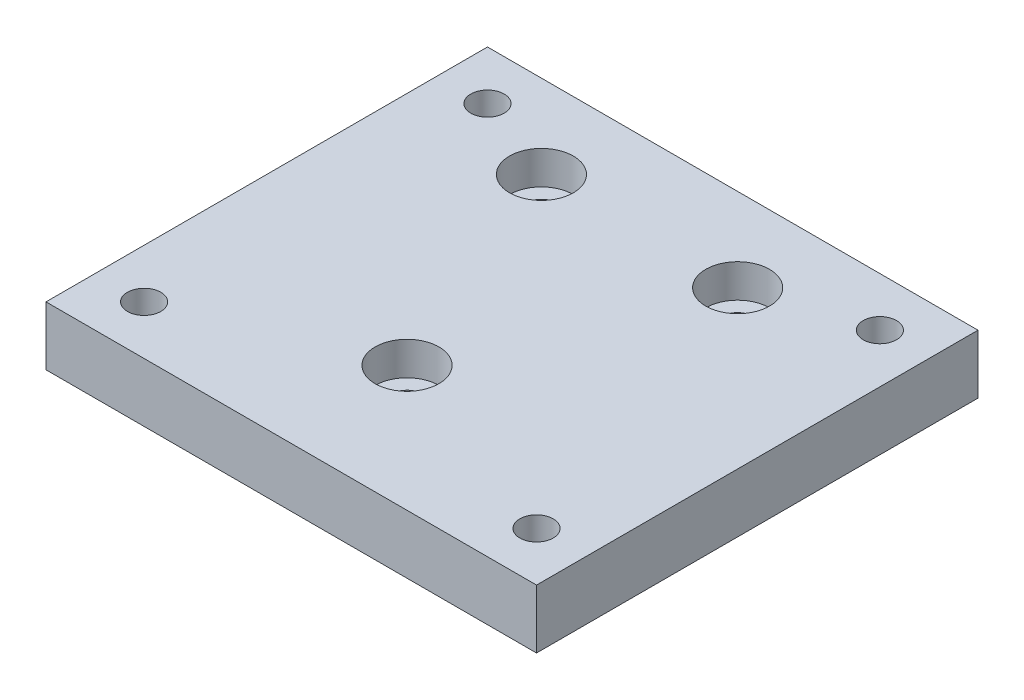
ISO-10303-21;
HEADER;
FILE_DESCRIPTION(('STEP AP214'),'2;1');
FILE_NAME('part.step','',(''),(''),'','','');
FILE_SCHEMA(('AUTOMOTIVE_DESIGN { 1 0 10303 214 1 1 1 1 }'));
ENDSEC;
DATA;
#1=APPLICATION_CONTEXT('core data for automotive mechanical design processes');
#2=APPLICATION_PROTOCOL_DEFINITION('international standard','automotive_design',2000,#1);
#3=PRODUCT_CONTEXT('',#1,'mechanical');
#4=PRODUCT('Part','Part','',(#3));
#5=PRODUCT_RELATED_PRODUCT_CATEGORY('part','',(#4));
#6=PRODUCT_DEFINITION_FORMATION('','',#4);
#7=PRODUCT_DEFINITION_CONTEXT('part definition',#1,'design');
#8=PRODUCT_DEFINITION('design','',#6,#7);
#9=PRODUCT_DEFINITION_SHAPE('','',#8);
#10=(LENGTH_UNIT() NAMED_UNIT(*) SI_UNIT(.MILLI.,.METRE.));
#11=(NAMED_UNIT(*) PLANE_ANGLE_UNIT() SI_UNIT($,.RADIAN.));
#12=(NAMED_UNIT(*) SI_UNIT($,.STERADIAN.) SOLID_ANGLE_UNIT());
#13=UNCERTAINTY_MEASURE_WITH_UNIT(LENGTH_MEASURE(1.E-05),#10,'distance_accuracy_value','');
#14=(GEOMETRIC_REPRESENTATION_CONTEXT(3) GLOBAL_UNCERTAINTY_ASSIGNED_CONTEXT((#13)) GLOBAL_UNIT_ASSIGNED_CONTEXT((#10,
#11,#12)) REPRESENTATION_CONTEXT('',''));
#15=CARTESIAN_POINT('',(0.,0.,0.));
#16=DIRECTION('',(0.,0.,1.));
#17=DIRECTION('',(1.,0.,0.));
#18=AXIS2_PLACEMENT_3D('',#15,#16,#17);
#19=CARTESIAN_POINT('',(25.,6.,-22.5));
#20=DIRECTION('',(-1.,0.,0.));
#21=DIRECTION('',(0.,0.,1.));
#22=AXIS2_PLACEMENT_3D('',#19,#20,#21);
#23=PLANE('',#22);
#24=DIRECTION('',(0.,0.,-1.));
#25=VECTOR('',#24,1.);
#26=CARTESIAN_POINT('',(25.,0.,-22.5));
#27=LINE('',#26,#25);
#28=CARTESIAN_POINT('',(25.,0.,22.5));
#29=VERTEX_POINT('',#28);
#30=CARTESIAN_POINT('',(25.,0.,-22.5));
#31=VERTEX_POINT('',#30);
#32=EDGE_CURVE('E99',#29,#31,#27,.T.);
#33=ORIENTED_EDGE('',*,*,#32,.T.);
#34=DIRECTION('',(0.,-1.,0.));
#35=VECTOR('',#34,1.);
#36=CARTESIAN_POINT('',(25.,6.,-22.5));
#37=LINE('',#36,#35);
#38=CARTESIAN_POINT('',(25.,6.,-22.5));
#39=VERTEX_POINT('',#38);
#40=EDGE_CURVE('E11',#39,#31,#37,.T.);
#41=ORIENTED_EDGE('',*,*,#40,.F.);
#42=DIRECTION('',(0.,0.,-1.));
#43=VECTOR('',#42,1.);
#44=CARTESIAN_POINT('',(25.,6.,-22.5));
#45=LINE('',#44,#43);
#46=CARTESIAN_POINT('',(25.,6.,22.5));
#47=VERTEX_POINT('',#46);
#48=EDGE_CURVE('E87',#47,#39,#45,.T.);
#49=ORIENTED_EDGE('',*,*,#48,.F.);
#50=DIRECTION('',(0.,-1.,0.));
#51=VECTOR('',#50,1.);
#52=CARTESIAN_POINT('',(25.,6.,22.5));
#53=LINE('',#52,#51);
#54=EDGE_CURVE('E95',#47,#29,#53,.T.);
#55=ORIENTED_EDGE('',*,*,#54,.T.);
#56=EDGE_LOOP('',(#33,#41,#49,#55));
#57=FACE_BOUND('',#56,.T.);
#58=ADVANCED_FACE('F36',(#57),#23,.F.);
#59=CARTESIAN_POINT('',(-25.,6.,-22.5));
#60=DIRECTION('',(0.,0.,1.));
#61=DIRECTION('',(1.,0.,0.));
#62=AXIS2_PLACEMENT_3D('',#59,#60,#61);
#63=PLANE('',#62);
#64=DIRECTION('',(-1.,0.,0.));
#65=VECTOR('',#64,1.);
#66=CARTESIAN_POINT('',(-25.,0.,-22.5));
#67=LINE('',#66,#65);
#68=CARTESIAN_POINT('',(-25.,0.,-22.5));
#69=VERTEX_POINT('',#68);
#70=EDGE_CURVE('E91',#31,#69,#67,.T.);
#71=ORIENTED_EDGE('',*,*,#70,.T.);
#72=DIRECTION('',(0.,-1.,0.));
#73=VECTOR('',#72,1.);
#74=CARTESIAN_POINT('',(-25.,6.,-22.5));
#75=LINE('',#74,#73);
#76=CARTESIAN_POINT('',(-25.,6.,-22.5));
#77=VERTEX_POINT('',#76);
#78=EDGE_CURVE('E44',#77,#69,#75,.T.);
#79=ORIENTED_EDGE('',*,*,#78,.F.);
#80=DIRECTION('',(-1.,0.,0.));
#81=VECTOR('',#80,1.);
#82=CARTESIAN_POINT('',(-25.,6.,-22.5));
#83=LINE('',#82,#81);
#84=EDGE_CURVE('E82',#39,#77,#83,.T.);
#85=ORIENTED_EDGE('',*,*,#84,.F.);
#86=ORIENTED_EDGE('',*,*,#40,.T.);
#87=EDGE_LOOP('',(#71,#79,#85,#86));
#88=FACE_BOUND('',#87,.T.);
#89=ADVANCED_FACE('F90',(#88),#63,.F.);
#90=CARTESIAN_POINT('',(-25.,6.,-22.5));
#91=DIRECTION('',(1.,0.,0.));
#92=DIRECTION('',(0.,0.,-1.));
#93=AXIS2_PLACEMENT_3D('',#90,#91,#92);
#94=PLANE('',#93);
#95=DIRECTION('',(0.,0.,1.));
#96=VECTOR('',#95,1.);
#97=CARTESIAN_POINT('',(-25.,0.,-22.5));
#98=LINE('',#97,#96);
#99=CARTESIAN_POINT('',(-25.,0.,22.5));
#100=VERTEX_POINT('',#99);
#101=EDGE_CURVE('E69',#69,#100,#98,.T.);
#102=ORIENTED_EDGE('',*,*,#101,.T.);
#103=DIRECTION('',(0.,-1.,0.));
#104=VECTOR('',#103,1.);
#105=CARTESIAN_POINT('',(-25.,6.,22.5));
#106=LINE('',#105,#104);
#107=CARTESIAN_POINT('',(-25.,6.,22.5));
#108=VERTEX_POINT('',#107);
#109=EDGE_CURVE('E92',#108,#100,#106,.T.);
#110=ORIENTED_EDGE('',*,*,#109,.F.);
#111=DIRECTION('',(0.,0.,1.));
#112=VECTOR('',#111,1.);
#113=CARTESIAN_POINT('',(-25.,6.,-22.5));
#114=LINE('',#113,#112);
#115=EDGE_CURVE('E85',#77,#108,#114,.T.);
#116=ORIENTED_EDGE('',*,*,#115,.F.);
#117=ORIENTED_EDGE('',*,*,#78,.T.);
#118=EDGE_LOOP('',(#102,#110,#116,#117));
#119=FACE_BOUND('',#118,.T.);
#120=ADVANCED_FACE('F93',(#119),#94,.F.);
#121=CARTESIAN_POINT('',(-25.,6.,22.5));
#122=DIRECTION('',(0.,0.,-1.));
#123=DIRECTION('',(-1.,0.,0.));
#124=AXIS2_PLACEMENT_3D('',#121,#122,#123);
#125=PLANE('',#124);
#126=DIRECTION('',(1.,0.,0.));
#127=VECTOR('',#126,1.);
#128=CARTESIAN_POINT('',(-25.,0.,22.5));
#129=LINE('',#128,#127);
#130=EDGE_CURVE('E75',#100,#29,#129,.T.);
#131=ORIENTED_EDGE('',*,*,#130,.T.);
#132=ORIENTED_EDGE('',*,*,#54,.F.);
#133=DIRECTION('',(1.,0.,0.));
#134=VECTOR('',#133,1.);
#135=CARTESIAN_POINT('',(-25.,6.,22.5));
#136=LINE('',#135,#134);
#137=EDGE_CURVE('E52',#108,#47,#136,.T.);
#138=ORIENTED_EDGE('',*,*,#137,.F.);
#139=ORIENTED_EDGE('',*,*,#109,.T.);
#140=EDGE_LOOP('',(#131,#132,#138,#139));
#141=FACE_BOUND('',#140,.T.);
#142=ADVANCED_FACE('F107',(#141),#125,.F.);
#143=CARTESIAN_POINT('',(0.,6.,0.));
#144=DIRECTION('',(0.,1.,0.));
#145=DIRECTION('',(0.,0.,1.));
#146=AXIS2_PLACEMENT_3D('',#143,#144,#145);
#147=PLANE('',#146);
#148=CARTESIAN_POINT('',(-11.,6.,-14.));
#149=DIRECTION('',(0.,1.,0.));
#150=DIRECTION('',(0.,0.,1.));
#151=AXIS2_PLACEMENT_3D('',#148,#149,#150);
#152=CIRCLE('',#151,3.25);
#153=CARTESIAN_POINT('',(-11.,6.,-10.75));
#154=VERTEX_POINT('',#153);
#155=EDGE_CURVE('E193',#154,#154,#152,.T.);
#156=ORIENTED_EDGE('',*,*,#155,.F.);
#157=EDGE_LOOP('',(#156));
#158=FACE_BOUND('',#157,.T.);
#159=CARTESIAN_POINT('',(9.,6.,-14.));
#160=DIRECTION('',(0.,1.,0.));
#161=DIRECTION('',(0.,0.,1.));
#162=AXIS2_PLACEMENT_3D('',#159,#160,#161);
#163=CIRCLE('',#162,3.25);
#164=CARTESIAN_POINT('',(9.,6.,-10.75));
#165=VERTEX_POINT('',#164);
#166=EDGE_CURVE('E181',#165,#165,#163,.T.);
#167=ORIENTED_EDGE('',*,*,#166,.F.);
#168=EDGE_LOOP('',(#167));
#169=FACE_BOUND('',#168,.T.);
#170=CARTESIAN_POINT('',(-0.999999999999999,6.,9.7));
#171=DIRECTION('',(0.,1.,0.));
#172=DIRECTION('',(0.,0.,1.));
#173=AXIS2_PLACEMENT_3D('',#170,#171,#172);
#174=CIRCLE('',#173,3.25);
#175=CARTESIAN_POINT('',(-0.999999999999999,6.,12.95));
#176=VERTEX_POINT('',#175);
#177=EDGE_CURVE('E169',#176,#176,#174,.T.);
#178=ORIENTED_EDGE('',*,*,#177,.F.);
#179=EDGE_LOOP('',(#178));
#180=FACE_BOUND('',#179,.T.);
#181=CARTESIAN_POINT('',(-20.,6.00000000000001,17.5));
#182=DIRECTION('',(0.,-1.,0.));
#183=DIRECTION('',(0.,0.,-1.));
#184=AXIS2_PLACEMENT_3D('',#181,#182,#183);
#185=CIRCLE('',#184,1.70000000000001);
#186=CARTESIAN_POINT('',(-20.,6.00000000000001,15.8));
#187=VERTEX_POINT('',#186);
#188=EDGE_CURVE('E148',#187,#187,#185,.T.);
#189=ORIENTED_EDGE('',*,*,#188,.T.);
#190=EDGE_LOOP('',(#189));
#191=FACE_BOUND('',#190,.T.);
#192=CARTESIAN_POINT('',(20.,6.00000000000001,17.5));
#193=DIRECTION('',(0.,-1.,0.));
#194=DIRECTION('',(0.,0.,-1.));
#195=AXIS2_PLACEMENT_3D('',#192,#193,#194);
#196=CIRCLE('',#195,1.70000000000001);
#197=CARTESIAN_POINT('',(20.,6.00000000000001,15.8));
#198=VERTEX_POINT('',#197);
#199=EDGE_CURVE('E136',#198,#198,#196,.T.);
#200=ORIENTED_EDGE('',*,*,#199,.T.);
#201=EDGE_LOOP('',(#200));
#202=FACE_BOUND('',#201,.T.);
#203=CARTESIAN_POINT('',(20.,6.00000000000001,-17.5));
#204=DIRECTION('',(0.,-1.,0.));
#205=DIRECTION('',(0.,0.,-1.));
#206=AXIS2_PLACEMENT_3D('',#203,#204,#205);
#207=CIRCLE('',#206,1.70000000000001);
#208=CARTESIAN_POINT('',(20.,6.00000000000001,-19.2));
#209=VERTEX_POINT('',#208);
#210=EDGE_CURVE('E124',#209,#209,#207,.T.);
#211=ORIENTED_EDGE('',*,*,#210,.T.);
#212=EDGE_LOOP('',(#211));
#213=FACE_BOUND('',#212,.T.);
#214=CARTESIAN_POINT('',(-20.,6.00000000000001,-17.5));
#215=DIRECTION('',(0.,-1.,0.));
#216=DIRECTION('',(0.,0.,-1.));
#217=AXIS2_PLACEMENT_3D('',#214,#215,#216);
#218=CIRCLE('',#217,1.70000000000001);
#219=CARTESIAN_POINT('',(-20.,6.00000000000001,-19.2));
#220=VERTEX_POINT('',#219);
#221=EDGE_CURVE('E102',#220,#220,#218,.T.);
#222=ORIENTED_EDGE('',*,*,#221,.T.);
#223=EDGE_LOOP('',(#222));
#224=FACE_BOUND('',#223,.T.);
#225=ORIENTED_EDGE('',*,*,#48,.T.);
#226=ORIENTED_EDGE('',*,*,#84,.T.);
#227=ORIENTED_EDGE('',*,*,#115,.T.);
#228=ORIENTED_EDGE('',*,*,#137,.T.);
#229=EDGE_LOOP('',(#225,#226,#227,#228));
#230=FACE_BOUND('',#229,.T.);
#231=ADVANCED_FACE('F83',(#158,#169,#180,#191,#202,#213,#224,#230),#147,.T.);
#232=CARTESIAN_POINT('',(0.,0.,0.));
#233=DIRECTION('',(0.,1.,0.));
#234=DIRECTION('',(0.,0.,1.));
#235=AXIS2_PLACEMENT_3D('',#232,#233,#234);
#236=PLANE('',#235);
#237=CARTESIAN_POINT('',(-11.,0.,-14.));
#238=DIRECTION('',(0.,1.,0.));
#239=DIRECTION('',(0.,0.,1.));
#240=AXIS2_PLACEMENT_3D('',#237,#238,#239);
#241=CIRCLE('',#240,1.7);
#242=CARTESIAN_POINT('',(-11.,0.,-12.3));
#243=VERTEX_POINT('',#242);
#244=EDGE_CURVE('E184',#243,#243,#241,.T.);
#245=ORIENTED_EDGE('',*,*,#244,.T.);
#246=EDGE_LOOP('',(#245));
#247=FACE_BOUND('',#246,.T.);
#248=CARTESIAN_POINT('',(9.,0.,-14.));
#249=DIRECTION('',(0.,1.,0.));
#250=DIRECTION('',(0.,0.,1.));
#251=AXIS2_PLACEMENT_3D('',#248,#249,#250);
#252=CIRCLE('',#251,1.7);
#253=CARTESIAN_POINT('',(9.,0.,-12.3));
#254=VERTEX_POINT('',#253);
#255=EDGE_CURVE('E172',#254,#254,#252,.T.);
#256=ORIENTED_EDGE('',*,*,#255,.T.);
#257=EDGE_LOOP('',(#256));
#258=FACE_BOUND('',#257,.T.);
#259=CARTESIAN_POINT('',(-0.999999999999999,0.,9.7));
#260=DIRECTION('',(0.,1.,0.));
#261=DIRECTION('',(0.,0.,1.));
#262=AXIS2_PLACEMENT_3D('',#259,#260,#261);
#263=CIRCLE('',#262,1.7);
#264=CARTESIAN_POINT('',(-0.999999999999999,0.,11.4));
#265=VERTEX_POINT('',#264);
#266=EDGE_CURVE('E160',#265,#265,#263,.T.);
#267=ORIENTED_EDGE('',*,*,#266,.T.);
#268=EDGE_LOOP('',(#267));
#269=FACE_BOUND('',#268,.T.);
#270=CARTESIAN_POINT('',(-20.,0.,17.5));
#271=DIRECTION('',(0.,-1.,0.));
#272=DIRECTION('',(0.,0.,-1.));
#273=AXIS2_PLACEMENT_3D('',#270,#271,#272);
#274=CIRCLE('',#273,3.25);
#275=CARTESIAN_POINT('',(-20.,0.,14.25));
#276=VERTEX_POINT('',#275);
#277=EDGE_CURVE('E157',#276,#276,#274,.T.);
#278=ORIENTED_EDGE('',*,*,#277,.F.);
#279=EDGE_LOOP('',(#278));
#280=FACE_BOUND('',#279,.T.);
#281=CARTESIAN_POINT('',(20.,0.,17.5));
#282=DIRECTION('',(0.,-1.,0.));
#283=DIRECTION('',(0.,0.,-1.));
#284=AXIS2_PLACEMENT_3D('',#281,#282,#283);
#285=CIRCLE('',#284,3.25);
#286=CARTESIAN_POINT('',(20.,0.,14.25));
#287=VERTEX_POINT('',#286);
#288=EDGE_CURVE('E145',#287,#287,#285,.T.);
#289=ORIENTED_EDGE('',*,*,#288,.F.);
#290=EDGE_LOOP('',(#289));
#291=FACE_BOUND('',#290,.T.);
#292=CARTESIAN_POINT('',(20.,0.,-17.5));
#293=DIRECTION('',(0.,-1.,0.));
#294=DIRECTION('',(0.,0.,-1.));
#295=AXIS2_PLACEMENT_3D('',#292,#293,#294);
#296=CIRCLE('',#295,3.25);
#297=CARTESIAN_POINT('',(20.,0.,-20.75));
#298=VERTEX_POINT('',#297);
#299=EDGE_CURVE('E133',#298,#298,#296,.T.);
#300=ORIENTED_EDGE('',*,*,#299,.F.);
#301=EDGE_LOOP('',(#300));
#302=FACE_BOUND('',#301,.T.);
#303=CARTESIAN_POINT('',(-20.,0.,-17.5));
#304=DIRECTION('',(0.,-1.,0.));
#305=DIRECTION('',(0.,0.,-1.));
#306=AXIS2_PLACEMENT_3D('',#303,#304,#305);
#307=CIRCLE('',#306,3.25);
#308=CARTESIAN_POINT('',(-20.,0.,-20.75));
#309=VERTEX_POINT('',#308);
#310=EDGE_CURVE('E121',#309,#309,#307,.T.);
#311=ORIENTED_EDGE('',*,*,#310,.F.);
#312=EDGE_LOOP('',(#311));
#313=FACE_BOUND('',#312,.T.);
#314=ORIENTED_EDGE('',*,*,#32,.F.);
#315=ORIENTED_EDGE('',*,*,#130,.F.);
#316=ORIENTED_EDGE('',*,*,#101,.F.);
#317=ORIENTED_EDGE('',*,*,#70,.F.);
#318=EDGE_LOOP('',(#314,#315,#316,#317));
#319=FACE_BOUND('',#318,.T.);
#320=ADVANCED_FACE('F110',(#247,#258,#269,#280,#291,#302,#313,#319),#236,.F.);
#321=CARTESIAN_POINT('',(-20.,0.,-17.5));
#322=DIRECTION('',(0.,-1.,0.));
#323=DIRECTION('',(0.,0.,-1.));
#324=AXIS2_PLACEMENT_3D('',#321,#322,#323);
#325=CYLINDRICAL_SURFACE('',#324,1.70000000000001);
#326=ORIENTED_EDGE('',*,*,#221,.F.);
#327=EDGE_LOOP('',(#326));
#328=FACE_BOUND('',#327,.T.);
#329=CARTESIAN_POINT('',(-20.,3.4,-17.5));
#330=DIRECTION('',(0.,-1.,0.));
#331=DIRECTION('',(0.,0.,-1.));
#332=AXIS2_PLACEMENT_3D('',#329,#330,#331);
#333=CIRCLE('',#332,1.7);
#334=CARTESIAN_POINT('',(-20.,3.4,-19.2));
#335=VERTEX_POINT('',#334);
#336=EDGE_CURVE('E115',#335,#335,#333,.T.);
#337=ORIENTED_EDGE('',*,*,#336,.T.);
#338=EDGE_LOOP('',(#337));
#339=FACE_BOUND('',#338,.T.);
#340=ADVANCED_FACE('F214',(#328,#339),#325,.F.);
#341=CARTESIAN_POINT('',(-18.3,3.4,-17.5));
#342=DIRECTION('',(0.,1.,0.));
#343=DIRECTION('',(0.,0.,1.));
#344=AXIS2_PLACEMENT_3D('',#341,#342,#343);
#345=PLANE('',#344);
#346=ORIENTED_EDGE('',*,*,#336,.F.);
#347=EDGE_LOOP('',(#346));
#348=FACE_BOUND('',#347,.T.);
#349=CARTESIAN_POINT('',(-20.,3.4,-17.5));
#350=DIRECTION('',(0.,-1.,0.));
#351=DIRECTION('',(0.,0.,-1.));
#352=AXIS2_PLACEMENT_3D('',#349,#350,#351);
#353=CIRCLE('',#352,3.25);
#354=CARTESIAN_POINT('',(-20.,3.4,-20.75));
#355=VERTEX_POINT('',#354);
#356=EDGE_CURVE('E118',#355,#355,#353,.T.);
#357=ORIENTED_EDGE('',*,*,#356,.T.);
#358=EDGE_LOOP('',(#357));
#359=FACE_BOUND('',#358,.T.);
#360=ADVANCED_FACE('F217',(#348,#359),#345,.F.);
#361=CARTESIAN_POINT('',(-20.,0.,-17.5));
#362=DIRECTION('',(0.,-1.,0.));
#363=DIRECTION('',(0.,0.,-1.));
#364=AXIS2_PLACEMENT_3D('',#361,#362,#363);
#365=CYLINDRICAL_SURFACE('',#364,3.25);
#366=ORIENTED_EDGE('',*,*,#356,.F.);
#367=EDGE_LOOP('',(#366));
#368=FACE_BOUND('',#367,.T.);
#369=ORIENTED_EDGE('',*,*,#310,.T.);
#370=EDGE_LOOP('',(#369));
#371=FACE_BOUND('',#370,.T.);
#372=ADVANCED_FACE('F223',(#368,#371),#365,.F.);
#373=CARTESIAN_POINT('',(20.,0.,-17.5));
#374=DIRECTION('',(0.,-1.,0.));
#375=DIRECTION('',(0.,0.,-1.));
#376=AXIS2_PLACEMENT_3D('',#373,#374,#375);
#377=CYLINDRICAL_SURFACE('',#376,1.70000000000001);
#378=ORIENTED_EDGE('',*,*,#210,.F.);
#379=EDGE_LOOP('',(#378));
#380=FACE_BOUND('',#379,.T.);
#381=CARTESIAN_POINT('',(20.,3.4,-17.5));
#382=DIRECTION('',(0.,-1.,0.));
#383=DIRECTION('',(0.,0.,-1.));
#384=AXIS2_PLACEMENT_3D('',#381,#382,#383);
#385=CIRCLE('',#384,1.7);
#386=CARTESIAN_POINT('',(20.,3.4,-19.2));
#387=VERTEX_POINT('',#386);
#388=EDGE_CURVE('E127',#387,#387,#385,.T.);
#389=ORIENTED_EDGE('',*,*,#388,.T.);
#390=EDGE_LOOP('',(#389));
#391=FACE_BOUND('',#390,.T.);
#392=ADVANCED_FACE('F229',(#380,#391),#377,.F.);
#393=CARTESIAN_POINT('',(21.7,3.4,-17.5));
#394=DIRECTION('',(0.,1.,0.));
#395=DIRECTION('',(0.,0.,1.));
#396=AXIS2_PLACEMENT_3D('',#393,#394,#395);
#397=PLANE('',#396);
#398=ORIENTED_EDGE('',*,*,#388,.F.);
#399=EDGE_LOOP('',(#398));
#400=FACE_BOUND('',#399,.T.);
#401=CARTESIAN_POINT('',(20.,3.4,-17.5));
#402=DIRECTION('',(0.,-1.,0.));
#403=DIRECTION('',(0.,0.,-1.));
#404=AXIS2_PLACEMENT_3D('',#401,#402,#403);
#405=CIRCLE('',#404,3.25);
#406=CARTESIAN_POINT('',(20.,3.4,-20.75));
#407=VERTEX_POINT('',#406);
#408=EDGE_CURVE('E130',#407,#407,#405,.T.);
#409=ORIENTED_EDGE('',*,*,#408,.T.);
#410=EDGE_LOOP('',(#409));
#411=FACE_BOUND('',#410,.T.);
#412=ADVANCED_FACE('F389',(#400,#411),#397,.F.);
#413=CARTESIAN_POINT('',(20.,0.,-17.5));
#414=DIRECTION('',(0.,-1.,0.));
#415=DIRECTION('',(0.,0.,-1.));
#416=AXIS2_PLACEMENT_3D('',#413,#414,#415);
#417=CYLINDRICAL_SURFACE('',#416,3.25);
#418=ORIENTED_EDGE('',*,*,#408,.F.);
#419=EDGE_LOOP('',(#418));
#420=FACE_BOUND('',#419,.T.);
#421=ORIENTED_EDGE('',*,*,#299,.T.);
#422=EDGE_LOOP('',(#421));
#423=FACE_BOUND('',#422,.T.);
#424=ADVANCED_FACE('F385',(#420,#423),#417,.F.);
#425=CARTESIAN_POINT('',(20.,0.,17.5));
#426=DIRECTION('',(0.,-1.,0.));
#427=DIRECTION('',(0.,0.,-1.));
#428=AXIS2_PLACEMENT_3D('',#425,#426,#427);
#429=CYLINDRICAL_SURFACE('',#428,1.70000000000001);
#430=ORIENTED_EDGE('',*,*,#199,.F.);
#431=EDGE_LOOP('',(#430));
#432=FACE_BOUND('',#431,.T.);
#433=CARTESIAN_POINT('',(20.,3.4,17.5));
#434=DIRECTION('',(0.,-1.,0.));
#435=DIRECTION('',(0.,0.,-1.));
#436=AXIS2_PLACEMENT_3D('',#433,#434,#435);
#437=CIRCLE('',#436,1.7);
#438=CARTESIAN_POINT('',(20.,3.4,15.8));
#439=VERTEX_POINT('',#438);
#440=EDGE_CURVE('E139',#439,#439,#437,.T.);
#441=ORIENTED_EDGE('',*,*,#440,.T.);
#442=EDGE_LOOP('',(#441));
#443=FACE_BOUND('',#442,.T.);
#444=ADVANCED_FACE('F381',(#432,#443),#429,.F.);
#445=CARTESIAN_POINT('',(21.7,3.4,17.5));
#446=DIRECTION('',(0.,1.,0.));
#447=DIRECTION('',(0.,0.,1.));
#448=AXIS2_PLACEMENT_3D('',#445,#446,#447);
#449=PLANE('',#448);
#450=ORIENTED_EDGE('',*,*,#440,.F.);
#451=EDGE_LOOP('',(#450));
#452=FACE_BOUND('',#451,.T.);
#453=CARTESIAN_POINT('',(20.,3.4,17.5));
#454=DIRECTION('',(0.,-1.,0.));
#455=DIRECTION('',(0.,0.,-1.));
#456=AXIS2_PLACEMENT_3D('',#453,#454,#455);
#457=CIRCLE('',#456,3.25);
#458=CARTESIAN_POINT('',(20.,3.4,14.25));
#459=VERTEX_POINT('',#458);
#460=EDGE_CURVE('E142',#459,#459,#457,.T.);
#461=ORIENTED_EDGE('',*,*,#460,.T.);
#462=EDGE_LOOP('',(#461));
#463=FACE_BOUND('',#462,.T.);
#464=ADVANCED_FACE('F377',(#452,#463),#449,.F.);
#465=CARTESIAN_POINT('',(20.,0.,17.5));
#466=DIRECTION('',(0.,-1.,0.));
#467=DIRECTION('',(0.,0.,-1.));
#468=AXIS2_PLACEMENT_3D('',#465,#466,#467);
#469=CYLINDRICAL_SURFACE('',#468,3.25);
#470=ORIENTED_EDGE('',*,*,#460,.F.);
#471=EDGE_LOOP('',(#470));
#472=FACE_BOUND('',#471,.T.);
#473=ORIENTED_EDGE('',*,*,#288,.T.);
#474=EDGE_LOOP('',(#473));
#475=FACE_BOUND('',#474,.T.);
#476=ADVANCED_FACE('F373',(#472,#475),#469,.F.);
#477=CARTESIAN_POINT('',(-20.,0.,17.5));
#478=DIRECTION('',(0.,-1.,0.));
#479=DIRECTION('',(0.,0.,-1.));
#480=AXIS2_PLACEMENT_3D('',#477,#478,#479);
#481=CYLINDRICAL_SURFACE('',#480,1.70000000000001);
#482=ORIENTED_EDGE('',*,*,#188,.F.);
#483=EDGE_LOOP('',(#482));
#484=FACE_BOUND('',#483,.T.);
#485=CARTESIAN_POINT('',(-20.,3.4,17.5));
#486=DIRECTION('',(0.,-1.,0.));
#487=DIRECTION('',(0.,0.,-1.));
#488=AXIS2_PLACEMENT_3D('',#485,#486,#487);
#489=CIRCLE('',#488,1.7);
#490=CARTESIAN_POINT('',(-20.,3.4,15.8));
#491=VERTEX_POINT('',#490);
#492=EDGE_CURVE('E151',#491,#491,#489,.T.);
#493=ORIENTED_EDGE('',*,*,#492,.T.);
#494=EDGE_LOOP('',(#493));
#495=FACE_BOUND('',#494,.T.);
#496=ADVANCED_FACE('F369',(#484,#495),#481,.F.);
#497=CARTESIAN_POINT('',(-18.3,3.4,17.5));
#498=DIRECTION('',(0.,1.,0.));
#499=DIRECTION('',(0.,0.,1.));
#500=AXIS2_PLACEMENT_3D('',#497,#498,#499);
#501=PLANE('',#500);
#502=ORIENTED_EDGE('',*,*,#492,.F.);
#503=EDGE_LOOP('',(#502));
#504=FACE_BOUND('',#503,.T.);
#505=CARTESIAN_POINT('',(-20.,3.4,17.5));
#506=DIRECTION('',(0.,-1.,0.));
#507=DIRECTION('',(0.,0.,-1.));
#508=AXIS2_PLACEMENT_3D('',#505,#506,#507);
#509=CIRCLE('',#508,3.25);
#510=CARTESIAN_POINT('',(-20.,3.4,14.25));
#511=VERTEX_POINT('',#510);
#512=EDGE_CURVE('E154',#511,#511,#509,.T.);
#513=ORIENTED_EDGE('',*,*,#512,.T.);
#514=EDGE_LOOP('',(#513));
#515=FACE_BOUND('',#514,.T.);
#516=ADVANCED_FACE('F365',(#504,#515),#501,.F.);
#517=CARTESIAN_POINT('',(-20.,0.,17.5));
#518=DIRECTION('',(0.,-1.,0.));
#519=DIRECTION('',(0.,0.,-1.));
#520=AXIS2_PLACEMENT_3D('',#517,#518,#519);
#521=CYLINDRICAL_SURFACE('',#520,3.25);
#522=ORIENTED_EDGE('',*,*,#512,.F.);
#523=EDGE_LOOP('',(#522));
#524=FACE_BOUND('',#523,.T.);
#525=ORIENTED_EDGE('',*,*,#277,.T.);
#526=EDGE_LOOP('',(#525));
#527=FACE_BOUND('',#526,.T.);
#528=ADVANCED_FACE('F264',(#524,#527),#521,.F.);
#529=CARTESIAN_POINT('',(-0.999999999999999,6.,9.7));
#530=DIRECTION('',(0.,1.,0.));
#531=DIRECTION('',(0.,0.,1.));
#532=AXIS2_PLACEMENT_3D('',#529,#530,#531);
#533=CYLINDRICAL_SURFACE('',#532,1.70000000000001);
#534=ORIENTED_EDGE('',*,*,#266,.F.);
#535=EDGE_LOOP('',(#534));
#536=FACE_BOUND('',#535,.T.);
#537=CARTESIAN_POINT('',(-0.999999999999999,2.6,9.7));
#538=DIRECTION('',(0.,1.,0.));
#539=DIRECTION('',(0.,0.,1.));
#540=AXIS2_PLACEMENT_3D('',#537,#538,#539);
#541=CIRCLE('',#540,1.70000000000001);
#542=CARTESIAN_POINT('',(-0.999999999999999,2.6,11.4));
#543=VERTEX_POINT('',#542);
#544=EDGE_CURVE('E163',#543,#543,#541,.T.);
#545=ORIENTED_EDGE('',*,*,#544,.T.);
#546=EDGE_LOOP('',(#545));
#547=FACE_BOUND('',#546,.T.);
#548=ADVANCED_FACE('F274',(#536,#547),#533,.F.);
#549=CARTESIAN_POINT('',(0.700000000000013,2.6,9.7));
#550=DIRECTION('',(0.,-1.,0.));
#551=DIRECTION('',(0.,0.,-1.));
#552=AXIS2_PLACEMENT_3D('',#549,#550,#551);
#553=PLANE('',#552);
#554=ORIENTED_EDGE('',*,*,#544,.F.);
#555=EDGE_LOOP('',(#554));
#556=FACE_BOUND('',#555,.T.);
#557=CARTESIAN_POINT('',(-0.999999999999999,2.6,9.7));
#558=DIRECTION('',(0.,1.,0.));
#559=DIRECTION('',(0.,0.,1.));
#560=AXIS2_PLACEMENT_3D('',#557,#558,#559);
#561=CIRCLE('',#560,3.25);
#562=CARTESIAN_POINT('',(-0.999999999999999,2.6,12.95));
#563=VERTEX_POINT('',#562);
#564=EDGE_CURVE('E166',#563,#563,#561,.T.);
#565=ORIENTED_EDGE('',*,*,#564,.T.);
#566=EDGE_LOOP('',(#565));
#567=FACE_BOUND('',#566,.T.);
#568=ADVANCED_FACE('F279',(#556,#567),#553,.F.);
#569=CARTESIAN_POINT('',(-0.999999999999999,6.,9.7));
#570=DIRECTION('',(0.,1.,0.));
#571=DIRECTION('',(0.,0.,1.));
#572=AXIS2_PLACEMENT_3D('',#569,#570,#571);
#573=CYLINDRICAL_SURFACE('',#572,3.25);
#574=ORIENTED_EDGE('',*,*,#564,.F.);
#575=EDGE_LOOP('',(#574));
#576=FACE_BOUND('',#575,.T.);
#577=ORIENTED_EDGE('',*,*,#177,.T.);
#578=EDGE_LOOP('',(#577));
#579=FACE_BOUND('',#578,.T.);
#580=ADVANCED_FACE('F289',(#576,#579),#573,.F.);
#581=CARTESIAN_POINT('',(9.,6.,-14.));
#582=DIRECTION('',(0.,1.,0.));
#583=DIRECTION('',(0.,0.,1.));
#584=AXIS2_PLACEMENT_3D('',#581,#582,#583);
#585=CYLINDRICAL_SURFACE('',#584,1.70000000000001);
#586=ORIENTED_EDGE('',*,*,#255,.F.);
#587=EDGE_LOOP('',(#586));
#588=FACE_BOUND('',#587,.T.);
#589=CARTESIAN_POINT('',(9.,2.6,-14.));
#590=DIRECTION('',(0.,1.,0.));
#591=DIRECTION('',(0.,0.,1.));
#592=AXIS2_PLACEMENT_3D('',#589,#590,#591);
#593=CIRCLE('',#592,1.70000000000001);
#594=CARTESIAN_POINT('',(9.,2.6,-12.3));
#595=VERTEX_POINT('',#594);
#596=EDGE_CURVE('E175',#595,#595,#593,.T.);
#597=ORIENTED_EDGE('',*,*,#596,.T.);
#598=EDGE_LOOP('',(#597));
#599=FACE_BOUND('',#598,.T.);
#600=ADVANCED_FACE('F299',(#588,#599),#585,.F.);
#601=CARTESIAN_POINT('',(10.7,2.6,-14.));
#602=DIRECTION('',(0.,-1.,0.));
#603=DIRECTION('',(0.,0.,-1.));
#604=AXIS2_PLACEMENT_3D('',#601,#602,#603);
#605=PLANE('',#604);
#606=ORIENTED_EDGE('',*,*,#596,.F.);
#607=EDGE_LOOP('',(#606));
#608=FACE_BOUND('',#607,.T.);
#609=CARTESIAN_POINT('',(9.,2.6,-14.));
#610=DIRECTION('',(0.,1.,0.));
#611=DIRECTION('',(0.,0.,1.));
#612=AXIS2_PLACEMENT_3D('',#609,#610,#611);
#613=CIRCLE('',#612,3.25);
#614=CARTESIAN_POINT('',(9.,2.6,-10.75));
#615=VERTEX_POINT('',#614);
#616=EDGE_CURVE('E178',#615,#615,#613,.T.);
#617=ORIENTED_EDGE('',*,*,#616,.T.);
#618=EDGE_LOOP('',(#617));
#619=FACE_BOUND('',#618,.T.);
#620=ADVANCED_FACE('F309',(#608,#619),#605,.F.);
#621=CARTESIAN_POINT('',(9.,6.,-14.));
#622=DIRECTION('',(0.,1.,0.));
#623=DIRECTION('',(0.,0.,1.));
#624=AXIS2_PLACEMENT_3D('',#621,#622,#623);
#625=CYLINDRICAL_SURFACE('',#624,3.25);
#626=ORIENTED_EDGE('',*,*,#616,.F.);
#627=EDGE_LOOP('',(#626));
#628=FACE_BOUND('',#627,.T.);
#629=ORIENTED_EDGE('',*,*,#166,.T.);
#630=EDGE_LOOP('',(#629));
#631=FACE_BOUND('',#630,.T.);
#632=ADVANCED_FACE('F319',(#628,#631),#625,.F.);
#633=CARTESIAN_POINT('',(-11.,6.,-14.));
#634=DIRECTION('',(0.,1.,0.));
#635=DIRECTION('',(0.,0.,1.));
#636=AXIS2_PLACEMENT_3D('',#633,#634,#635);
#637=CYLINDRICAL_SURFACE('',#636,1.70000000000001);
#638=ORIENTED_EDGE('',*,*,#244,.F.);
#639=EDGE_LOOP('',(#638));
#640=FACE_BOUND('',#639,.T.);
#641=CARTESIAN_POINT('',(-11.,2.6,-14.));
#642=DIRECTION('',(0.,1.,0.));
#643=DIRECTION('',(0.,0.,1.));
#644=AXIS2_PLACEMENT_3D('',#641,#642,#643);
#645=CIRCLE('',#644,1.70000000000001);
#646=CARTESIAN_POINT('',(-11.,2.6,-12.3));
#647=VERTEX_POINT('',#646);
#648=EDGE_CURVE('E187',#647,#647,#645,.T.);
#649=ORIENTED_EDGE('',*,*,#648,.T.);
#650=EDGE_LOOP('',(#649));
#651=FACE_BOUND('',#650,.T.);
#652=ADVANCED_FACE('F329',(#640,#651),#637,.F.);
#653=CARTESIAN_POINT('',(-9.29999999999999,2.6,-14.));
#654=DIRECTION('',(0.,-1.,0.));
#655=DIRECTION('',(0.,0.,-1.));
#656=AXIS2_PLACEMENT_3D('',#653,#654,#655);
#657=PLANE('',#656);
#658=ORIENTED_EDGE('',*,*,#648,.F.);
#659=EDGE_LOOP('',(#658));
#660=FACE_BOUND('',#659,.T.);
#661=CARTESIAN_POINT('',(-11.,2.6,-14.));
#662=DIRECTION('',(0.,1.,0.));
#663=DIRECTION('',(0.,0.,1.));
#664=AXIS2_PLACEMENT_3D('',#661,#662,#663);
#665=CIRCLE('',#664,3.25);
#666=CARTESIAN_POINT('',(-11.,2.6,-10.75));
#667=VERTEX_POINT('',#666);
#668=EDGE_CURVE('E190',#667,#667,#665,.T.);
#669=ORIENTED_EDGE('',*,*,#668,.T.);
#670=EDGE_LOOP('',(#669));
#671=FACE_BOUND('',#670,.T.);
#672=ADVANCED_FACE('F339',(#660,#671),#657,.F.);
#673=CARTESIAN_POINT('',(-11.,6.,-14.));
#674=DIRECTION('',(0.,1.,0.));
#675=DIRECTION('',(0.,0.,1.));
#676=AXIS2_PLACEMENT_3D('',#673,#674,#675);
#677=CYLINDRICAL_SURFACE('',#676,3.25);
#678=ORIENTED_EDGE('',*,*,#668,.F.);
#679=EDGE_LOOP('',(#678));
#680=FACE_BOUND('',#679,.T.);
#681=ORIENTED_EDGE('',*,*,#155,.T.);
#682=EDGE_LOOP('',(#681));
#683=FACE_BOUND('',#682,.T.);
#684=ADVANCED_FACE('F197',(#680,#683),#677,.F.);
#685=CLOSED_SHELL('',(#58,#89,#120,#142,#231,#320,#340,#360,#372,#392,#412,#424,#444,#464,#476,
#496,#516,#528,#548,#568,#580,#600,#620,#632,#652,#672,#684));
#686=MANIFOLD_SOLID_BREP('B2',#685);
#687=ADVANCED_BREP_SHAPE_REPRESENTATION('',(#18,#686),#14);
#688=SHAPE_DEFINITION_REPRESENTATION(#9,#687);
ENDSEC;
END-ISO-10303-21;
